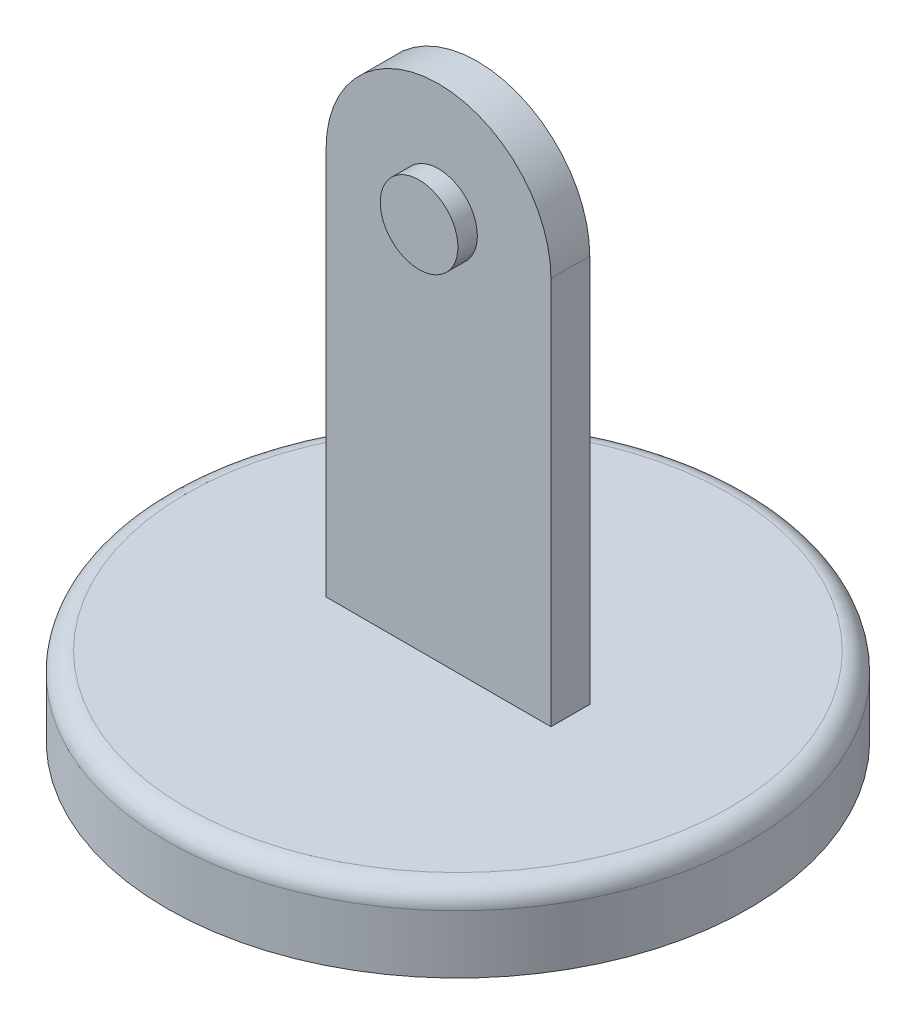
ISO-10303-21;
HEADER;
FILE_DESCRIPTION(('STEP AP214'),'2;1');
FILE_NAME('part.step','',(''),(''),'','','');
FILE_SCHEMA(('AUTOMOTIVE_DESIGN { 1 0 10303 214 1 1 1 1 }'));
ENDSEC;
DATA;
#1=APPLICATION_CONTEXT('core data for automotive mechanical design processes');
#2=APPLICATION_PROTOCOL_DEFINITION('international standard','automotive_design',2000,#1);
#3=PRODUCT_CONTEXT('',#1,'mechanical');
#4=PRODUCT('Part','Part','',(#3));
#5=PRODUCT_RELATED_PRODUCT_CATEGORY('part','',(#4));
#6=PRODUCT_DEFINITION_FORMATION('','',#4);
#7=PRODUCT_DEFINITION_CONTEXT('part definition',#1,'design');
#8=PRODUCT_DEFINITION('design','',#6,#7);
#9=PRODUCT_DEFINITION_SHAPE('','',#8);
#10=(LENGTH_UNIT() NAMED_UNIT(*) SI_UNIT(.MILLI.,.METRE.));
#11=(NAMED_UNIT(*) PLANE_ANGLE_UNIT() SI_UNIT($,.RADIAN.));
#12=(NAMED_UNIT(*) SI_UNIT($,.STERADIAN.) SOLID_ANGLE_UNIT());
#13=UNCERTAINTY_MEASURE_WITH_UNIT(LENGTH_MEASURE(1.E-05),#10,'distance_accuracy_value','');
#14=(GEOMETRIC_REPRESENTATION_CONTEXT(3) GLOBAL_UNCERTAINTY_ASSIGNED_CONTEXT((#13)) GLOBAL_UNIT_ASSIGNED_CONTEXT((#10,
#11,#12)) REPRESENTATION_CONTEXT('',''));
#15=CARTESIAN_POINT('',(0.,0.,0.));
#16=DIRECTION('',(0.,0.,1.));
#17=DIRECTION('',(1.,0.,0.));
#18=AXIS2_PLACEMENT_3D('',#15,#16,#17);
#19=CARTESIAN_POINT('',(0.,20.,0.));
#20=DIRECTION('',(0.,1.,0.));
#21=DIRECTION('',(0.,0.,1.));
#22=AXIS2_PLACEMENT_3D('',#19,#20,#21);
#23=PLANE('',#22);
#24=CARTESIAN_POINT('',(0.,20.,0.));
#25=DIRECTION('',(0.,1.,0.));
#26=DIRECTION('',(0.,0.,1.));
#27=AXIS2_PLACEMENT_3D('',#24,#25,#26);
#28=CIRCLE('',#27,70.);
#29=CARTESIAN_POINT('',(0.,20.,70.));
#30=VERTEX_POINT('',#29);
#31=EDGE_CURVE('E48',#30,#30,#28,.T.);
#32=ORIENTED_EDGE('',*,*,#31,.T.);
#33=EDGE_LOOP('',(#32));
#34=FACE_BOUND('',#33,.T.);
#35=DIRECTION('',(0.,0.,1.));
#36=VECTOR('',#35,1.);
#37=CARTESIAN_POINT('',(-28.9585651191265,20.,-5.));
#38=LINE('',#37,#36);
#39=CARTESIAN_POINT('',(-28.9585651191265,20.,-5.));
#40=VERTEX_POINT('',#39);
#41=CARTESIAN_POINT('',(-28.9585651191265,20.,5.));
#42=VERTEX_POINT('',#41);
#43=EDGE_CURVE('E60',#40,#42,#38,.T.);
#44=ORIENTED_EDGE('',*,*,#43,.F.);
#45=DIRECTION('',(1.,0.,0.));
#46=VECTOR('',#45,1.);
#47=CARTESIAN_POINT('',(0.,20.,-5.));
#48=LINE('',#47,#46);
#49=CARTESIAN_POINT('',(28.9585651191265,20.,-5.));
#50=VERTEX_POINT('',#49);
#51=EDGE_CURVE('E55',#40,#50,#48,.T.);
#52=ORIENTED_EDGE('',*,*,#51,.T.);
#53=DIRECTION('',(0.,0.,1.));
#54=VECTOR('',#53,1.);
#55=CARTESIAN_POINT('',(28.9585651191265,20.,-5.));
#56=LINE('',#55,#54);
#57=CARTESIAN_POINT('',(28.9585651191265,20.,5.));
#58=VERTEX_POINT('',#57);
#59=EDGE_CURVE('E117',#50,#58,#56,.T.);
#60=ORIENTED_EDGE('',*,*,#59,.T.);
#61=DIRECTION('',(1.,0.,0.));
#62=VECTOR('',#61,1.);
#63=CARTESIAN_POINT('',(0.,20.,5.));
#64=LINE('',#63,#62);
#65=EDGE_CURVE('E102',#42,#58,#64,.T.);
#66=ORIENTED_EDGE('',*,*,#65,.F.);
#67=EDGE_LOOP('',(#44,#52,#60,#66));
#68=FACE_BOUND('',#67,.T.);
#69=ADVANCED_FACE('F39',(#34,#68),#23,.T.);
#70=CARTESIAN_POINT('',(0.,20.,0.));
#71=DIRECTION('',(0.,-1.,0.));
#72=DIRECTION('',(0.,0.,-1.));
#73=AXIS2_PLACEMENT_3D('',#70,#71,#72);
#74=CYLINDRICAL_SURFACE('',#73,75.);
#75=CARTESIAN_POINT('',(0.,15.,0.));
#76=DIRECTION('',(0.,1.,0.));
#77=DIRECTION('',(0.,0.,1.));
#78=AXIS2_PLACEMENT_3D('',#75,#76,#77);
#79=CIRCLE('',#78,75.);
#80=CARTESIAN_POINT('',(0.,15.,75.));
#81=VERTEX_POINT('',#80);
#82=EDGE_CURVE('E11',#81,#81,#79,.F.);
#83=ORIENTED_EDGE('',*,*,#82,.T.);
#84=EDGE_LOOP('',(#83));
#85=FACE_BOUND('',#84,.T.);
#86=CARTESIAN_POINT('',(0.,0.,0.));
#87=DIRECTION('',(0.,1.,0.));
#88=DIRECTION('',(0.,0.,1.));
#89=AXIS2_PLACEMENT_3D('',#86,#87,#88);
#90=CIRCLE('',#89,75.);
#91=CARTESIAN_POINT('',(0.,0.,75.));
#92=VERTEX_POINT('',#91);
#93=EDGE_CURVE('E119',#92,#92,#90,.T.);
#94=ORIENTED_EDGE('',*,*,#93,.T.);
#95=EDGE_LOOP('',(#94));
#96=FACE_BOUND('',#95,.T.);
#97=ADVANCED_FACE('F137',(#85,#96),#74,.T.);
#98=CARTESIAN_POINT('',(0.,0.,0.));
#99=DIRECTION('',(0.,1.,0.));
#100=DIRECTION('',(0.,0.,1.));
#101=AXIS2_PLACEMENT_3D('',#98,#99,#100);
#102=PLANE('',#101);
#103=ORIENTED_EDGE('',*,*,#93,.F.);
#104=EDGE_LOOP('',(#103));
#105=FACE_BOUND('',#104,.T.);
#106=ADVANCED_FACE('F129',(#105),#102,.F.);
#107=CARTESIAN_POINT('',(0.,15.,0.));
#108=DIRECTION('',(0.,1.,0.));
#109=DIRECTION('',(0.,0.,1.));
#110=AXIS2_PLACEMENT_3D('',#107,#108,#109);
#111=TOROIDAL_SURFACE('',#110,70.,5.);
#112=ORIENTED_EDGE('',*,*,#82,.F.);
#113=EDGE_LOOP('',(#112));
#114=FACE_BOUND('',#113,.T.);
#115=ORIENTED_EDGE('',*,*,#31,.F.);
#116=EDGE_LOOP('',(#115));
#117=FACE_BOUND('',#116,.T.);
#118=ADVANCED_FACE('F41',(#114,#117),#111,.T.);
#119=CARTESIAN_POINT('',(28.9585651191265,0.,-5.));
#120=DIRECTION('',(-1.,0.,0.));
#121=DIRECTION('',(0.,-1.,0.));
#122=AXIS2_PLACEMENT_3D('',#119,#120,#121);
#123=PLANE('',#122);
#124=DIRECTION('',(0.,0.,1.));
#125=VECTOR('',#124,1.);
#126=CARTESIAN_POINT('',(28.9585651191265,120.,-5.));
#127=LINE('',#126,#125);
#128=CARTESIAN_POINT('',(28.9585651191265,120.,-5.));
#129=VERTEX_POINT('',#128);
#130=CARTESIAN_POINT('',(28.9585651191265,120.,5.));
#131=VERTEX_POINT('',#130);
#132=EDGE_CURVE('E80',#129,#131,#127,.T.);
#133=ORIENTED_EDGE('',*,*,#132,.T.);
#134=DIRECTION('',(0.,-1.,0.));
#135=VECTOR('',#134,1.);
#136=CARTESIAN_POINT('',(28.9585651191265,0.,5.));
#137=LINE('',#136,#135);
#138=EDGE_CURVE('E85',#131,#58,#137,.T.);
#139=ORIENTED_EDGE('',*,*,#138,.T.);
#140=ORIENTED_EDGE('',*,*,#59,.F.);
#141=DIRECTION('',(0.,-1.,0.));
#142=VECTOR('',#141,1.);
#143=CARTESIAN_POINT('',(28.9585651191265,0.,-5.));
#144=LINE('',#143,#142);
#145=EDGE_CURVE('E86',#129,#50,#144,.T.);
#146=ORIENTED_EDGE('',*,*,#145,.F.);
#147=EDGE_LOOP('',(#133,#139,#140,#146));
#148=FACE_BOUND('',#147,.T.);
#149=ADVANCED_FACE('F82',(#148),#123,.F.);
#150=CARTESIAN_POINT('',(-28.9585651191265,0.,-5.));
#151=DIRECTION('',(-1.,0.,0.));
#152=DIRECTION('',(0.,-1.,0.));
#153=AXIS2_PLACEMENT_3D('',#150,#151,#152);
#154=PLANE('',#153);
#155=ORIENTED_EDGE('',*,*,#43,.T.);
#156=DIRECTION('',(0.,-1.,0.));
#157=VECTOR('',#156,1.);
#158=CARTESIAN_POINT('',(-28.9585651191265,0.,5.));
#159=LINE('',#158,#157);
#160=CARTESIAN_POINT('',(-28.9585651191265,120.,5.));
#161=VERTEX_POINT('',#160);
#162=EDGE_CURVE('E98',#161,#42,#159,.T.);
#163=ORIENTED_EDGE('',*,*,#162,.F.);
#164=DIRECTION('',(0.,0.,1.));
#165=VECTOR('',#164,1.);
#166=CARTESIAN_POINT('',(-28.9585651191265,120.,-5.));
#167=LINE('',#166,#165);
#168=CARTESIAN_POINT('',(-28.9585651191265,120.,-5.));
#169=VERTEX_POINT('',#168);
#170=EDGE_CURVE('E90',#169,#161,#167,.T.);
#171=ORIENTED_EDGE('',*,*,#170,.F.);
#172=DIRECTION('',(0.,-1.,0.));
#173=VECTOR('',#172,1.);
#174=CARTESIAN_POINT('',(-28.9585651191265,0.,-5.));
#175=LINE('',#174,#173);
#176=EDGE_CURVE('E114',#169,#40,#175,.T.);
#177=ORIENTED_EDGE('',*,*,#176,.T.);
#178=EDGE_LOOP('',(#155,#163,#171,#177));
#179=FACE_BOUND('',#178,.T.);
#180=ADVANCED_FACE('F135',(#179),#154,.T.);
#181=CARTESIAN_POINT('',(0.,120.,-5.));
#182=DIRECTION('',(0.,0.,1.));
#183=DIRECTION('',(1.,0.,0.));
#184=AXIS2_PLACEMENT_3D('',#181,#182,#183);
#185=CYLINDRICAL_SURFACE('',#184,28.9585651191265);
#186=ORIENTED_EDGE('',*,*,#170,.T.);
#187=CARTESIAN_POINT('',(0.,120.,5.));
#188=DIRECTION('',(0.,0.,1.));
#189=DIRECTION('',(1.,0.,0.));
#190=AXIS2_PLACEMENT_3D('',#187,#188,#189);
#191=CIRCLE('',#190,28.9585651191265);
#192=EDGE_CURVE('E93',#131,#161,#191,.T.);
#193=ORIENTED_EDGE('',*,*,#192,.F.);
#194=ORIENTED_EDGE('',*,*,#132,.F.);
#195=CARTESIAN_POINT('',(0.,120.,-5.));
#196=DIRECTION('',(0.,0.,1.));
#197=DIRECTION('',(1.,0.,0.));
#198=AXIS2_PLACEMENT_3D('',#195,#196,#197);
#199=CIRCLE('',#198,28.9585651191265);
#200=EDGE_CURVE('E112',#129,#169,#199,.T.);
#201=ORIENTED_EDGE('',*,*,#200,.T.);
#202=EDGE_LOOP('',(#186,#193,#194,#201));
#203=FACE_BOUND('',#202,.T.);
#204=ADVANCED_FACE('F94',(#203),#185,.T.);
#205=CARTESIAN_POINT('',(0.,0.,-5.));
#206=DIRECTION('',(0.,0.,1.));
#207=DIRECTION('',(1.,0.,0.));
#208=AXIS2_PLACEMENT_3D('',#205,#206,#207);
#209=PLANE('',#208);
#210=CARTESIAN_POINT('',(0.,120.,-5.));
#211=DIRECTION('',(0.,0.,1.));
#212=DIRECTION('',(1.,0.,0.));
#213=AXIS2_PLACEMENT_3D('',#210,#211,#212);
#214=CIRCLE('',#213,5.);
#215=CARTESIAN_POINT('',(5.,120.,-5.));
#216=VERTEX_POINT('',#215);
#217=EDGE_CURVE('E180',#216,#216,#214,.T.);
#218=ORIENTED_EDGE('',*,*,#217,.T.);
#219=EDGE_LOOP('',(#218));
#220=FACE_BOUND('',#219,.T.);
#221=ORIENTED_EDGE('',*,*,#145,.T.);
#222=ORIENTED_EDGE('',*,*,#51,.F.);
#223=ORIENTED_EDGE('',*,*,#176,.F.);
#224=ORIENTED_EDGE('',*,*,#200,.F.);
#225=EDGE_LOOP('',(#221,#222,#223,#224));
#226=FACE_BOUND('',#225,.T.);
#227=ADVANCED_FACE('F150',(#220,#226),#209,.F.);
#228=CARTESIAN_POINT('',(0.,0.,5.));
#229=DIRECTION('',(0.,0.,1.));
#230=DIRECTION('',(1.,0.,0.));
#231=AXIS2_PLACEMENT_3D('',#228,#229,#230);
#232=PLANE('',#231);
#233=CARTESIAN_POINT('',(0.,120.,5.));
#234=DIRECTION('',(0.,0.,1.));
#235=DIRECTION('',(1.,0.,0.));
#236=AXIS2_PLACEMENT_3D('',#233,#234,#235);
#237=CIRCLE('',#236,10.);
#238=CARTESIAN_POINT('',(10.,120.,5.));
#239=VERTEX_POINT('',#238);
#240=EDGE_CURVE('E43',#239,#239,#237,.F.);
#241=ORIENTED_EDGE('',*,*,#240,.T.);
#242=EDGE_LOOP('',(#241));
#243=FACE_BOUND('',#242,.T.);
#244=ORIENTED_EDGE('',*,*,#138,.F.);
#245=ORIENTED_EDGE('',*,*,#192,.T.);
#246=ORIENTED_EDGE('',*,*,#162,.T.);
#247=ORIENTED_EDGE('',*,*,#65,.T.);
#248=EDGE_LOOP('',(#244,#245,#246,#247));
#249=FACE_BOUND('',#248,.T.);
#250=ADVANCED_FACE('F101',(#243,#249),#232,.T.);
#251=CARTESIAN_POINT('',(0.,120.,10.));
#252=DIRECTION('',(0.,0.,-1.));
#253=DIRECTION('',(-1.,0.,0.));
#254=AXIS2_PLACEMENT_3D('',#251,#252,#253);
#255=CYLINDRICAL_SURFACE('',#254,10.);
#256=ORIENTED_EDGE('',*,*,#240,.F.);
#257=EDGE_LOOP('',(#256));
#258=FACE_BOUND('',#257,.T.);
#259=CARTESIAN_POINT('',(0.,120.,10.));
#260=DIRECTION('',(0.,0.,1.));
#261=DIRECTION('',(1.,0.,0.));
#262=AXIS2_PLACEMENT_3D('',#259,#260,#261);
#263=CIRCLE('',#262,10.);
#264=CARTESIAN_POINT('',(10.,120.,10.));
#265=VERTEX_POINT('',#264);
#266=EDGE_CURVE('E105',#265,#265,#263,.T.);
#267=ORIENTED_EDGE('',*,*,#266,.F.);
#268=EDGE_LOOP('',(#267));
#269=FACE_BOUND('',#268,.T.);
#270=ADVANCED_FACE('F159',(#258,#269),#255,.T.);
#271=CARTESIAN_POINT('',(0.,0.,10.));
#272=DIRECTION('',(0.,0.,1.));
#273=DIRECTION('',(1.,0.,0.));
#274=AXIS2_PLACEMENT_3D('',#271,#272,#273);
#275=PLANE('',#274);
#276=ORIENTED_EDGE('',*,*,#266,.T.);
#277=EDGE_LOOP('',(#276));
#278=FACE_BOUND('',#277,.T.);
#279=ADVANCED_FACE('F163',(#278),#275,.T.);
#280=CARTESIAN_POINT('',(0.,120.,5.));
#281=DIRECTION('',(0.,0.,-1.));
#282=DIRECTION('',(-1.,0.,0.));
#283=AXIS2_PLACEMENT_3D('',#280,#281,#282);
#284=CYLINDRICAL_SURFACE('',#283,5.);
#285=CARTESIAN_POINT('',(0.,120.,5.));
#286=DIRECTION('',(0.,0.,1.));
#287=DIRECTION('',(1.,0.,0.));
#288=AXIS2_PLACEMENT_3D('',#285,#286,#287);
#289=CIRCLE('',#288,5.);
#290=CARTESIAN_POINT('',(5.,120.,5.));
#291=VERTEX_POINT('',#290);
#292=EDGE_CURVE('E179',#291,#291,#289,.T.);
#293=ORIENTED_EDGE('',*,*,#292,.T.);
#294=EDGE_LOOP('',(#293));
#295=FACE_BOUND('',#294,.T.);
#296=ORIENTED_EDGE('',*,*,#217,.F.);
#297=EDGE_LOOP('',(#296));
#298=FACE_BOUND('',#297,.T.);
#299=ADVANCED_FACE('F167',(#295,#298),#284,.F.);
#300=CARTESIAN_POINT('',(0.,120.,5.));
#301=DIRECTION('',(0.,0.,1.));
#302=DIRECTION('',(1.,0.,0.));
#303=AXIS2_PLACEMENT_3D('',#300,#301,#302);
#304=PLANE('',#303);
#305=ORIENTED_EDGE('',*,*,#292,.F.);
#306=EDGE_LOOP('',(#305));
#307=FACE_BOUND('',#306,.T.);
#308=ADVANCED_FACE('F171',(#307),#304,.F.);
#309=CLOSED_SHELL('',(#69,#97,#106,#118,#149,#180,#204,#227,#250,#270,#279,#299,#308));
#310=MANIFOLD_SOLID_BREP('B2',#309);
#311=ADVANCED_BREP_SHAPE_REPRESENTATION('',(#18,#310),#14);
#312=SHAPE_DEFINITION_REPRESENTATION(#9,#311);
ENDSEC;
END-ISO-10303-21;
